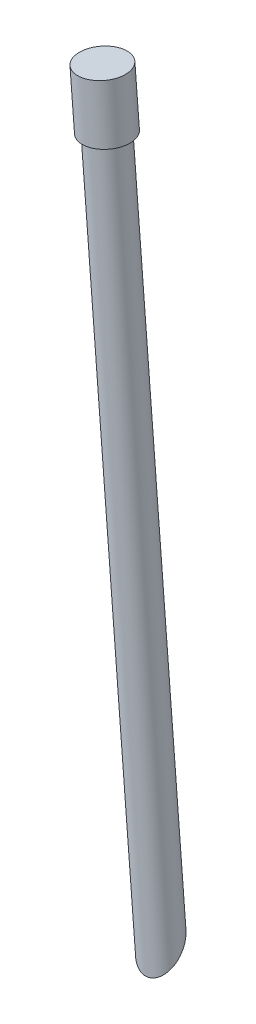
ISO-10303-21;
HEADER;
FILE_DESCRIPTION(('STEP AP214'),'2;1');
FILE_NAME('part.step','',(''),(''),'','','');
FILE_SCHEMA(('AUTOMOTIVE_DESIGN { 1 0 10303 214 1 1 1 1 }'));
ENDSEC;
DATA;
#1=APPLICATION_CONTEXT('core data for automotive mechanical design processes');
#2=APPLICATION_PROTOCOL_DEFINITION('international standard','automotive_design',2000,#1);
#3=PRODUCT_CONTEXT('',#1,'mechanical');
#4=PRODUCT('Part','Part','',(#3));
#5=PRODUCT_RELATED_PRODUCT_CATEGORY('part','',(#4));
#6=PRODUCT_DEFINITION_FORMATION('','',#4);
#7=PRODUCT_DEFINITION_CONTEXT('part definition',#1,'design');
#8=PRODUCT_DEFINITION('design','',#6,#7);
#9=PRODUCT_DEFINITION_SHAPE('','',#8);
#10=(LENGTH_UNIT() NAMED_UNIT(*) SI_UNIT(.MILLI.,.METRE.));
#11=(NAMED_UNIT(*) PLANE_ANGLE_UNIT() SI_UNIT($,.RADIAN.));
#12=(NAMED_UNIT(*) SI_UNIT($,.STERADIAN.) SOLID_ANGLE_UNIT());
#13=UNCERTAINTY_MEASURE_WITH_UNIT(LENGTH_MEASURE(1.E-05),#10,'distance_accuracy_value','');
#14=(GEOMETRIC_REPRESENTATION_CONTEXT(3) GLOBAL_UNCERTAINTY_ASSIGNED_CONTEXT((#13)) GLOBAL_UNIT_ASSIGNED_CONTEXT((#10,
#11,#12)) REPRESENTATION_CONTEXT('',''));
#15=CARTESIAN_POINT('',(0.,0.,0.));
#16=DIRECTION('',(0.,0.,1.));
#17=DIRECTION('',(1.,0.,0.));
#18=AXIS2_PLACEMENT_3D('',#15,#16,#17);
#19=CARTESIAN_POINT('',(3.05023369920446,255.390679145159,0.));
#20=DIRECTION('',(0.0794029549851619,-0.99684260078491,0.));
#21=DIRECTION('',(0.99684260078491,0.0794029549851619,0.));
#22=AXIS2_PLACEMENT_3D('',#19,#20,#21);
#23=PLANE('',#22);
#24=CARTESIAN_POINT('',(3.05023369920459,255.390679145159,0.));
#25=DIRECTION('',(-0.0794029549851619,0.99684260078491,0.));
#26=DIRECTION('',(-0.99684260078491,-0.0794029549851619,0.));
#27=AXIS2_PLACEMENT_3D('',#24,#25,#26);
#28=CIRCLE('',#27,1.98743013570403);
#29=CARTESIAN_POINT('',(1.06907867385108,255.232871319557,0.));
#30=VERTEX_POINT('',#29);
#31=EDGE_CURVE('E10',#30,#30,#28,.T.);
#32=ORIENTED_EDGE('',*,*,#31,.T.);
#33=EDGE_LOOP('',(#32));
#34=FACE_BOUND('',#33,.T.);
#35=ADVANCED_FACE('F35',(#34),#23,.F.);
#36=CARTESIAN_POINT('',(2.31501393944986,264.620793787609,0.));
#37=DIRECTION('',(-0.0794029549851619,0.99684260078491,0.));
#38=DIRECTION('',(-0.99684260078491,-0.0794029549851619,0.));
#39=AXIS2_PLACEMENT_3D('',#36,#37,#38);
#40=CYLINDRICAL_SURFACE('',#39,1.98743013570403);
#41=ORIENTED_EDGE('',*,*,#31,.F.);
#42=EDGE_LOOP('',(#41));
#43=FACE_BOUND('',#42,.T.);
#44=CARTESIAN_POINT('',(3.44415760665564,250.445269588446,0.));
#45=DIRECTION('',(-0.0794029549851619,0.99684260078491,0.));
#46=DIRECTION('',(-0.99684260078491,-0.0794029549851619,0.));
#47=AXIS2_PLACEMENT_3D('',#44,#45,#46);
#48=CIRCLE('',#47,1.98743013570403);
#49=CARTESIAN_POINT('',(1.46300258130212,250.287461762845,0.));
#50=VERTEX_POINT('',#49);
#51=EDGE_CURVE('E46',#50,#50,#48,.T.);
#52=ORIENTED_EDGE('',*,*,#51,.T.);
#53=EDGE_LOOP('',(#52));
#54=FACE_BOUND('',#53,.T.);
#55=ADVANCED_FACE('F70',(#43,#54),#40,.T.);
#56=CARTESIAN_POINT('',(3.44164075013408,250.476866772722,0.));
#57=DIRECTION('',(0.0794029549851619,-0.99684260078491,0.));
#58=DIRECTION('',(0.99684260078491,0.0794029549851619,0.));
#59=AXIS2_PLACEMENT_3D('',#56,#57,#58);
#60=CONICAL_SURFACE('',#59,1.58949552127778,1.49130969717983);
#61=ORIENTED_EDGE('',*,*,#51,.F.);
#62=EDGE_LOOP('',(#61));
#63=FACE_BOUND('',#62,.T.);
#64=CARTESIAN_POINT('',(3.44164075013408,250.476866772722,0.));
#65=DIRECTION('',(-0.0794029549851619,0.99684260078491,0.));
#66=DIRECTION('',(-0.99684260078491,-0.0794029549851619,0.));
#67=AXIS2_PLACEMENT_3D('',#64,#65,#66);
#68=CIRCLE('',#67,1.58949552127778);
#69=CARTESIAN_POINT('',(1.85716390076757,250.350656131397,0.));
#70=VERTEX_POINT('',#69);
#71=EDGE_CURVE('E50',#70,#70,#68,.T.);
#72=ORIENTED_EDGE('',*,*,#71,.T.);
#73=EDGE_LOOP('',(#72));
#74=FACE_BOUND('',#73,.T.);
#75=ADVANCED_FACE('F67',(#63,#74),#60,.F.);
#76=CARTESIAN_POINT('',(2.31501393944986,264.620793787609,0.));
#77=DIRECTION('',(-0.0794029549851619,0.99684260078491,0.));
#78=DIRECTION('',(-0.99684260078491,-0.0794029549851619,0.));
#79=AXIS2_PLACEMENT_3D('',#76,#77,#78);
#80=CYLINDRICAL_SURFACE('',#79,1.58949552127778);
#81=CARTESIAN_POINT('',(7.16138326464008,191.102115070779,1.23019814032699));
#82=CARTESIAN_POINT('',(7.23229552579355,191.03919469572,1.28394998137421));
#83=CARTESIAN_POINT('',(7.30879884732793,190.979043130474,1.33368319858708));
#84=CARTESIAN_POINT('',(7.47297255003005,190.866761393197,1.42258641591768));
#85=CARTESIAN_POINT('',(7.5606187028706,190.81461434405,1.46177877597085));
#86=CARTESIAN_POINT('',(7.72101224154953,190.734376063486,1.51751698941154));
#87=CARTESIAN_POINT('',(7.79127650812043,190.703606526419,1.53732505144587));
#88=CARTESIAN_POINT('',(7.93655812797751,190.649731730499,1.56808757066889));
#89=CARTESIAN_POINT('',(8.01156973619942,190.626617411096,1.57905251660626));
#90=CARTESIAN_POINT('',(8.15264723096088,190.592763548643,1.58966593970083));
#91=CARTESIAN_POINT('',(8.21826516035333,190.580649696362,1.59082269721615));
#92=CARTESIAN_POINT('',(8.35012415239133,190.564137890616,1.58502459350744));
#93=CARTESIAN_POINT('',(8.41636479302528,190.559735043931,1.57807488112445));
#94=CARTESIAN_POINT('',(8.54770861513043,190.559217750557,1.55579165159899));
#95=CARTESIAN_POINT('',(8.61280713378697,190.563131690853,1.5404295539948));
#96=CARTESIAN_POINT('',(8.73951334554394,190.579243488446,1.50173714973292));
#97=CARTESIAN_POINT('',(8.80112070086593,190.591442145833,1.47840607358687));
#98=CARTESIAN_POINT('',(8.91601267712403,190.622563980173,1.42621825729255));
#99=CARTESIAN_POINT('',(8.96956368828961,190.641103683259,1.39771274851557));
#100=CARTESIAN_POINT('',(9.07105290094204,190.684014291288,1.3356133518217));
#101=CARTESIAN_POINT('',(9.11898885598184,190.708387518294,1.30201743960326));
#102=CARTESIAN_POINT('',(9.22645274941763,190.77242833922,1.21690737180328));
#103=CARTESIAN_POINT('',(9.28316531740472,190.814347005303,1.16352960890253));
#104=CARTESIAN_POINT('',(9.38499653607012,190.904917519671,1.05167260009606));
#105=CARTESIAN_POINT('',(9.4300911016222,190.953583038786,0.993183087750098));
#106=CARTESIAN_POINT('',(9.52435306980997,191.07491821467,0.850317197201138));
#107=CARTESIAN_POINT('',(9.56861465130559,191.149707033101,0.764514058302374));
#108=CARTESIAN_POINT('',(9.63865666143367,191.304539793642,0.590241879461885));
#109=CARTESIAN_POINT('',(9.66440728756516,191.38459198463,0.501768778413107));
#110=CARTESIAN_POINT('',(9.70515228396298,191.574666982696,0.294729737330918));
#111=CARTESIAN_POINT('',(9.71373215930118,191.685812130668,0.175930062550231));
#112=CARTESIAN_POINT('',(9.70459185055877,191.909420535555,-0.0593472994526023));
#113=CARTESIAN_POINT('',(9.68684561680292,192.021884988638,-0.175822571062681));
#114=CARTESIAN_POINT('',(9.62623735722751,192.246837198417,-0.405323386435331));
#115=CARTESIAN_POINT('',(9.58303046439035,192.359303652209,-0.518278695682898));
#116=CARTESIAN_POINT('',(9.47169077202967,192.579765016741,-0.73597194282751));
#117=CARTESIAN_POINT('',(9.40357913619403,192.687763637697,-0.840716766367695));
#118=CARTESIAN_POINT('',(9.25997558180356,192.872631852178,-1.01608377955568));
#119=CARTESIAN_POINT('',(9.18947391031394,192.951091715441,-1.08912059101975));
#120=CARTESIAN_POINT('',(9.03271211336089,193.100774270069,-1.2250796996719));
#121=CARTESIAN_POINT('',(8.94647547763594,193.172007506205,-1.288016814296));
#122=CARTESIAN_POINT('',(8.78292628080113,193.286497273421,-1.38522562850872));
#123=CARTESIAN_POINT('',(8.70921858882906,193.332187926892,-1.42268461237164));
#124=CARTESIAN_POINT('',(8.55355160531122,193.415850693723,-1.48790944238165));
#125=CARTESIAN_POINT('',(8.47160410458322,193.453833607932,-1.51568889217466));
#126=CARTESIAN_POINT('',(8.31814579056628,193.512948855445,-1.55462642987395));
#127=CARTESIAN_POINT('',(8.24792544654084,193.535938546444,-1.56802131972199));
#128=CARTESIAN_POINT('',(8.10425705298336,193.574149165316,-1.58576976128242));
#129=CARTESIAN_POINT('',(8.03081092103388,193.589374642547,-1.59012861216472));
#130=CARTESIAN_POINT('',(7.88208515069246,193.610875706757,-1.58870878152959));
#131=CARTESIAN_POINT('',(7.80679587991185,193.617083156894,-1.58285364966403));
#132=CARTESIAN_POINT('',(7.65767492882799,193.619506715707,-1.56039242021951));
#133=CARTESIAN_POINT('',(7.58384233089137,193.615729330888,-1.54379332914154));
#134=CARTESIAN_POINT('',(7.44930109011969,193.599321623756,-1.50305938814872));
#135=CARTESIAN_POINT('',(7.38809172292816,193.587830514692,-1.4800944384268));
#136=CARTESIAN_POINT('',(7.27061033931721,193.557799740933,-1.42724578861329));
#137=CARTESIAN_POINT('',(7.21433865801083,193.539259598287,-1.39736161942512));
#138=CARTESIAN_POINT('',(7.1070234936347,193.495736328952,-1.33140862315557));
#139=CARTESIAN_POINT('',(7.05607150075654,193.470660383624,-1.29525343990504));
#140=CARTESIAN_POINT('',(6.96089771373851,193.415308458457,-1.21840317001645));
#141=CARTESIAN_POINT('',(6.91667931064619,193.385029874787,-1.17770581369214));
#142=CARTESIAN_POINT('',(6.81552604387084,193.304812749865,-1.07265834578818));
#143=CARTESIAN_POINT('',(6.76262419067689,193.252397523921,-1.0063051871757));
#144=CARTESIAN_POINT('',(6.67098093836434,193.141238668374,-0.869243552775393));
#145=CARTESIAN_POINT('',(6.63227202149298,193.08248091572,-0.798525513913773));
#146=CARTESIAN_POINT('',(6.55627298254859,192.938728576321,-0.628945258745028));
#147=CARTESIAN_POINT('',(6.52453817524203,192.851919059728,-0.529137904781321));
#148=CARTESIAN_POINT('',(6.48240324519275,192.674012417613,-0.32897873369321));
#149=CARTESIAN_POINT('',(6.47202814227083,192.582910391598,-0.228626415958337));
#150=CARTESIAN_POINT('',(6.47022045341109,192.375301713388,-0.00426829254035981));
#151=CARTESIAN_POINT('',(6.48428080964012,192.25823034852,0.119257397804577));
#152=CARTESIAN_POINT('',(6.53985018598438,192.024279026188,0.360510953826005));
#153=CARTESIAN_POINT('',(6.58140381048129,191.907399689684,0.478229063384259));
#154=CARTESIAN_POINT('',(6.66503919303544,191.731267352243,0.651341202822836));
#155=CARTESIAN_POINT('',(6.69773408386407,191.670695173723,0.710073055496886));
#156=CARTESIAN_POINT('',(6.7705133234503,191.551020224341,0.824461323252689));
#157=CARTESIAN_POINT('',(6.81059973807343,191.491917869535,0.880116872868537));
#158=CARTESIAN_POINT('',(6.89810901934113,191.375938418544,0.987575403331041));
#159=CARTESIAN_POINT('',(6.94551710025396,191.31905712086,1.03938584368184));
#160=CARTESIAN_POINT('',(7.04780433952546,191.208191126775,1.13844603706649));
#161=CARTESIAN_POINT('',(7.10267788211459,191.154204295215,1.18569917302856));
#162=CARTESIAN_POINT('',(7.16138326464008,191.102115070779,1.23019814032699));
#163=B_SPLINE_CURVE_WITH_KNOTS('',3,(#81,#82,#83,#84,#85,#86,#87,#88,#89,#90,#91,#92,#93,#94,
#95,#96,#97,#98,#99,#100,#101,#102,#103,#104,#105,#106,#107,#108,#109,#110,#111,#112,#113,#114,
#115,#116,#117,#118,#119,#120,#121,#122,#123,#124,#125,#126,#127,#128,#129,#130,#131,#132,#133,
#134,#135,#136,#137,#138,#139,#140,#141,#142,#143,#144,#145,#146,#147,#148,#149,#150,#151,#152,
#153,#154,#155,#156,#157,#158,#159,#160,#161,#162),.UNSPECIFIED.,.T.,.F.,(4,2,2,2,2,2,2,2,2,2,2,
2,2,2,2,2,2,2,2,2,2,2,2,2,2,2,2,2,2,2,2,2,2,2,2,2,2,2,2,2,4),(0.,0.326725893297966,
0.652753148465093,0.889594166403929,1.12615385427017,1.32551747678992,1.52475454201378,
1.72467273835261,1.92461024434785,2.11413065020916,2.30372662145082,2.56759602396711,
2.83200812716359,3.19638616307309,3.56134953897174,4.04754731735734,4.53422650927161,
5.02765445817448,5.52066407000826,5.9042909486137,6.28734975191299,6.56980088713991,
6.85185344827112,7.0762542941817,7.30052350332036,7.52647854891641,7.75228638980673,
7.95047794211194,8.14868293498146,8.3498726346911,8.55116332117704,8.84872732943975,
9.14696815973914,9.55285915306384,9.95922531940657,10.4690129095142,10.9796296007987,
11.250780043849,11.5220063862379,11.7926919951506,12.0631750996948),.UNSPECIFIED.);
#164=CARTESIAN_POINT('',(7.16138326464008,191.102115070779,1.23019814032699));
#165=VERTEX_POINT('',#164);
#166=EDGE_CURVE('E38',#165,#165,#163,.T.);
#167=ORIENTED_EDGE('',*,*,#166,.T.);
#168=EDGE_LOOP('',(#167));
#169=FACE_BOUND('',#168,.T.);
#170=ORIENTED_EDGE('',*,*,#71,.F.);
#171=EDGE_LOOP('',(#170));
#172=FACE_BOUND('',#171,.T.);
#173=ADVANCED_FACE('F59',(#169,#172),#80,.T.);
#174=CARTESIAN_POINT('',(0.,141.580277667396,-47.2909422819565));
#175=DIRECTION('',(0.,1.,0.));
#176=DIRECTION('',(0.,0.,-1.));
#177=AXIS2_PLACEMENT_3D('',#174,#175,#176);
#178=SPHERICAL_SURFACE('',#177,69.6993461802126);
#179=ORIENTED_EDGE('',*,*,#166,.F.);
#180=EDGE_LOOP('',(#179));
#181=FACE_BOUND('',#180,.T.);
#182=ADVANCED_FACE('F62',(#181),#178,.F.);
#183=CLOSED_SHELL('',(#35,#55,#75,#173,#182));
#184=MANIFOLD_SOLID_BREP('B2',#183);
#185=ADVANCED_BREP_SHAPE_REPRESENTATION('',(#18,#184),#14);
#186=SHAPE_DEFINITION_REPRESENTATION(#9,#185);
ENDSEC;
END-ISO-10303-21;
